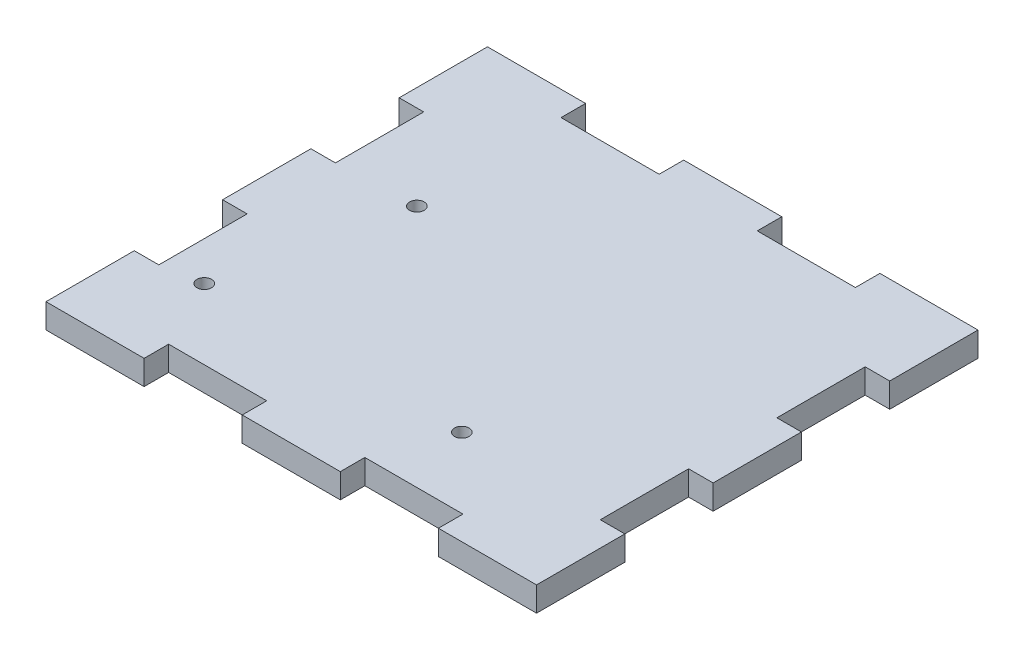
ISO-10303-21;
HEADER;
FILE_DESCRIPTION(('STEP AP214'),'2;1');
FILE_NAME('part.step','',(''),(''),'','','');
FILE_SCHEMA(('AUTOMOTIVE_DESIGN { 1 0 10303 214 1 1 1 1 }'));
ENDSEC;
DATA;
#1=APPLICATION_CONTEXT('core data for automotive mechanical design processes');
#2=APPLICATION_PROTOCOL_DEFINITION('international standard','automotive_design',2000,#1);
#3=PRODUCT_CONTEXT('',#1,'mechanical');
#4=PRODUCT('Part','Part','',(#3));
#5=PRODUCT_RELATED_PRODUCT_CATEGORY('part','',(#4));
#6=PRODUCT_DEFINITION_FORMATION('','',#4);
#7=PRODUCT_DEFINITION_CONTEXT('part definition',#1,'design');
#8=PRODUCT_DEFINITION('design','',#6,#7);
#9=PRODUCT_DEFINITION_SHAPE('','',#8);
#10=(LENGTH_UNIT() NAMED_UNIT(*) SI_UNIT(.MILLI.,.METRE.));
#11=(NAMED_UNIT(*) PLANE_ANGLE_UNIT() SI_UNIT($,.RADIAN.));
#12=(NAMED_UNIT(*) SI_UNIT($,.STERADIAN.) SOLID_ANGLE_UNIT());
#13=UNCERTAINTY_MEASURE_WITH_UNIT(LENGTH_MEASURE(1.E-05),#10,'distance_accuracy_value','');
#14=(GEOMETRIC_REPRESENTATION_CONTEXT(3) GLOBAL_UNCERTAINTY_ASSIGNED_CONTEXT((#13)) GLOBAL_UNIT_ASSIGNED_CONTEXT((#10,
#11,#12)) REPRESENTATION_CONTEXT('',''));
#15=CARTESIAN_POINT('',(0.,0.,0.));
#16=DIRECTION('',(0.,0.,1.));
#17=DIRECTION('',(1.,0.,0.));
#18=AXIS2_PLACEMENT_3D('',#15,#16,#17);
#19=CARTESIAN_POINT('',(-63.5,6.35,57.15));
#20=DIRECTION('',(0.,0.,-1.));
#21=DIRECTION('',(-1.,0.,0.));
#22=AXIS2_PLACEMENT_3D('',#19,#20,#21);
#23=PLANE('',#22);
#24=DIRECTION('',(1.,0.,0.));
#25=VECTOR('',#24,1.);
#26=CARTESIAN_POINT('',(-63.5,6.35,57.15));
#27=LINE('',#26,#25);
#28=CARTESIAN_POINT('',(-12.7,6.35,57.15));
#29=VERTEX_POINT('',#28);
#30=CARTESIAN_POINT('',(12.7,6.35,57.15));
#31=VERTEX_POINT('',#30);
#32=EDGE_CURVE('E521',#29,#31,#27,.T.);
#33=ORIENTED_EDGE('',*,*,#32,.F.);
#34=DIRECTION('',(0.,1.,0.));
#35=VECTOR('',#34,1.);
#36=CARTESIAN_POINT('',(-12.7,0.,57.15));
#37=LINE('',#36,#35);
#38=CARTESIAN_POINT('',(-12.7,0.,57.15));
#39=VERTEX_POINT('',#38);
#40=EDGE_CURVE('E314',#39,#29,#37,.T.);
#41=ORIENTED_EDGE('',*,*,#40,.F.);
#42=DIRECTION('',(1.,0.,0.));
#43=VECTOR('',#42,1.);
#44=CARTESIAN_POINT('',(-63.5,0.,57.15));
#45=LINE('',#44,#43);
#46=CARTESIAN_POINT('',(12.7,0.,57.15));
#47=VERTEX_POINT('',#46);
#48=EDGE_CURVE('E68',#39,#47,#45,.T.);
#49=ORIENTED_EDGE('',*,*,#48,.T.);
#50=DIRECTION('',(0.,1.,0.));
#51=VECTOR('',#50,1.);
#52=CARTESIAN_POINT('',(12.7,0.,57.15));
#53=LINE('',#52,#51);
#54=EDGE_CURVE('E340',#47,#31,#53,.T.);
#55=ORIENTED_EDGE('',*,*,#54,.T.);
#56=EDGE_LOOP('',(#33,#41,#49,#55));
#57=FACE_BOUND('',#56,.T.);
#58=ADVANCED_FACE('F45',(#57),#23,.F.);
#59=CARTESIAN_POINT('',(38.1,6.35,57.15));
#60=VERTEX_POINT('',#59);
#61=CARTESIAN_POINT('',(63.5,6.35,57.15));
#62=VERTEX_POINT('',#61);
#63=EDGE_CURVE('E515',#60,#62,#27,.T.);
#64=ORIENTED_EDGE('',*,*,#63,.F.);
#65=DIRECTION('',(0.,1.,0.));
#66=VECTOR('',#65,1.);
#67=CARTESIAN_POINT('',(38.1,0.,57.15));
#68=LINE('',#67,#66);
#69=CARTESIAN_POINT('',(38.1,0.,57.15));
#70=VERTEX_POINT('',#69);
#71=EDGE_CURVE('E338',#70,#60,#68,.T.);
#72=ORIENTED_EDGE('',*,*,#71,.F.);
#73=CARTESIAN_POINT('',(63.5,0.,57.15));
#74=VERTEX_POINT('',#73);
#75=EDGE_CURVE('E535',#70,#74,#45,.T.);
#76=ORIENTED_EDGE('',*,*,#75,.T.);
#77=DIRECTION('',(0.,-1.,0.));
#78=VECTOR('',#77,1.);
#79=CARTESIAN_POINT('',(63.5,6.35,57.15));
#80=LINE('',#79,#78);
#81=EDGE_CURVE('E520',#62,#74,#80,.T.);
#82=ORIENTED_EDGE('',*,*,#81,.F.);
#83=EDGE_LOOP('',(#64,#72,#76,#82));
#84=FACE_BOUND('',#83,.T.);
#85=ADVANCED_FACE('F593',(#84),#23,.F.);
#86=CARTESIAN_POINT('',(63.5,6.35,57.15));
#87=DIRECTION('',(-1.,0.,0.));
#88=DIRECTION('',(0.,0.,1.));
#89=AXIS2_PLACEMENT_3D('',#86,#87,#88);
#90=PLANE('',#89);
#91=DIRECTION('',(0.,0.,-1.));
#92=VECTOR('',#91,1.);
#93=CARTESIAN_POINT('',(63.5,0.,57.15));
#94=LINE('',#93,#92);
#95=CARTESIAN_POINT('',(63.5,0.,11.43));
#96=VERTEX_POINT('',#95);
#97=CARTESIAN_POINT('',(63.5,0.,-11.43));
#98=VERTEX_POINT('',#97);
#99=EDGE_CURVE('E526',#96,#98,#94,.T.);
#100=ORIENTED_EDGE('',*,*,#99,.T.);
#101=DIRECTION('',(0.,1.,0.));
#102=VECTOR('',#101,1.);
#103=CARTESIAN_POINT('',(63.5,0.,-11.43));
#104=LINE('',#103,#102);
#105=CARTESIAN_POINT('',(63.5,6.35,-11.43));
#106=VERTEX_POINT('',#105);
#107=EDGE_CURVE('E353',#98,#106,#104,.T.);
#108=ORIENTED_EDGE('',*,*,#107,.T.);
#109=DIRECTION('',(0.,0.,-1.));
#110=VECTOR('',#109,1.);
#111=CARTESIAN_POINT('',(63.5,6.35,57.15));
#112=LINE('',#111,#110);
#113=CARTESIAN_POINT('',(63.5,6.35,11.43));
#114=VERTEX_POINT('',#113);
#115=EDGE_CURVE('E505',#114,#106,#112,.T.);
#116=ORIENTED_EDGE('',*,*,#115,.F.);
#117=DIRECTION('',(0.,1.,0.));
#118=VECTOR('',#117,1.);
#119=CARTESIAN_POINT('',(63.5,0.,11.43));
#120=LINE('',#119,#118);
#121=EDGE_CURVE('E391',#96,#114,#120,.T.);
#122=ORIENTED_EDGE('',*,*,#121,.F.);
#123=EDGE_LOOP('',(#100,#108,#116,#122));
#124=FACE_BOUND('',#123,.T.);
#125=ADVANCED_FACE('F599',(#124),#90,.F.);
#126=CARTESIAN_POINT('',(63.5,0.,34.29));
#127=VERTEX_POINT('',#126);
#128=EDGE_CURVE('E522',#74,#127,#94,.T.);
#129=ORIENTED_EDGE('',*,*,#128,.T.);
#130=DIRECTION('',(0.,1.,0.));
#131=VECTOR('',#130,1.);
#132=CARTESIAN_POINT('',(63.5,0.,34.29));
#133=LINE('',#132,#131);
#134=CARTESIAN_POINT('',(63.5,6.35,34.29));
#135=VERTEX_POINT('',#134);
#136=EDGE_CURVE('E379',#127,#135,#133,.T.);
#137=ORIENTED_EDGE('',*,*,#136,.T.);
#138=EDGE_CURVE('E501',#62,#135,#112,.T.);
#139=ORIENTED_EDGE('',*,*,#138,.F.);
#140=ORIENTED_EDGE('',*,*,#81,.T.);
#141=EDGE_LOOP('',(#129,#137,#139,#140));
#142=FACE_BOUND('',#141,.T.);
#143=ADVANCED_FACE('F651',(#142),#90,.F.);
#144=CARTESIAN_POINT('',(-63.5,6.35,-57.15));
#145=DIRECTION('',(0.,0.,1.));
#146=DIRECTION('',(1.,0.,0.));
#147=AXIS2_PLACEMENT_3D('',#144,#145,#146);
#148=PLANE('',#147);
#149=DIRECTION('',(-1.,0.,0.));
#150=VECTOR('',#149,1.);
#151=CARTESIAN_POINT('',(-63.5,6.35,-57.15));
#152=LINE('',#151,#150);
#153=CARTESIAN_POINT('',(12.7,6.35,-57.15));
#154=VERTEX_POINT('',#153);
#155=CARTESIAN_POINT('',(-12.7,6.35,-57.15));
#156=VERTEX_POINT('',#155);
#157=EDGE_CURVE('E511',#154,#156,#152,.T.);
#158=ORIENTED_EDGE('',*,*,#157,.F.);
#159=DIRECTION('',(0.,1.,0.));
#160=VECTOR('',#159,1.);
#161=CARTESIAN_POINT('',(12.7,0.,-57.15));
#162=LINE('',#161,#160);
#163=CARTESIAN_POINT('',(12.7,0.,-57.15));
#164=VERTEX_POINT('',#163);
#165=EDGE_CURVE('E412',#164,#154,#162,.T.);
#166=ORIENTED_EDGE('',*,*,#165,.F.);
#167=DIRECTION('',(-1.,0.,0.));
#168=VECTOR('',#167,1.);
#169=CARTESIAN_POINT('',(-63.5,0.,-57.15));
#170=LINE('',#169,#168);
#171=CARTESIAN_POINT('',(-12.7,0.,-57.15));
#172=VERTEX_POINT('',#171);
#173=EDGE_CURVE('E531',#164,#172,#170,.T.);
#174=ORIENTED_EDGE('',*,*,#173,.T.);
#175=DIRECTION('',(0.,1.,0.));
#176=VECTOR('',#175,1.);
#177=CARTESIAN_POINT('',(-12.7,0.,-57.15));
#178=LINE('',#177,#176);
#179=EDGE_CURVE('E442',#172,#156,#178,.T.);
#180=ORIENTED_EDGE('',*,*,#179,.T.);
#181=EDGE_LOOP('',(#158,#166,#174,#180));
#182=FACE_BOUND('',#181,.T.);
#183=ADVANCED_FACE('F572',(#182),#148,.F.);
#184=CARTESIAN_POINT('',(-38.1,6.35,-57.15));
#185=VERTEX_POINT('',#184);
#186=CARTESIAN_POINT('',(-63.5,6.35,-57.15));
#187=VERTEX_POINT('',#186);
#188=EDGE_CURVE('E504',#185,#187,#152,.T.);
#189=ORIENTED_EDGE('',*,*,#188,.F.);
#190=DIRECTION('',(0.,1.,0.));
#191=VECTOR('',#190,1.);
#192=CARTESIAN_POINT('',(-38.1,0.,-57.15));
#193=LINE('',#192,#191);
#194=CARTESIAN_POINT('',(-38.1,0.,-57.15));
#195=VERTEX_POINT('',#194);
#196=EDGE_CURVE('E439',#195,#185,#193,.T.);
#197=ORIENTED_EDGE('',*,*,#196,.F.);
#198=CARTESIAN_POINT('',(-63.5,0.,-57.15));
#199=VERTEX_POINT('',#198);
#200=EDGE_CURVE('E525',#195,#199,#170,.T.);
#201=ORIENTED_EDGE('',*,*,#200,.T.);
#202=DIRECTION('',(0.,-1.,0.));
#203=VECTOR('',#202,1.);
#204=CARTESIAN_POINT('',(-63.5,6.35,-57.15));
#205=LINE('',#204,#203);
#206=EDGE_CURVE('E53',#187,#199,#205,.T.);
#207=ORIENTED_EDGE('',*,*,#206,.F.);
#208=EDGE_LOOP('',(#189,#197,#201,#207));
#209=FACE_BOUND('',#208,.T.);
#210=ADVANCED_FACE('F574',(#209),#148,.F.);
#211=CARTESIAN_POINT('',(-63.5,6.35,57.15));
#212=DIRECTION('',(1.,0.,0.));
#213=DIRECTION('',(0.,0.,-1.));
#214=AXIS2_PLACEMENT_3D('',#211,#212,#213);
#215=PLANE('',#214);
#216=DIRECTION('',(0.,0.,1.));
#217=VECTOR('',#216,1.);
#218=CARTESIAN_POINT('',(-63.5,0.,57.15));
#219=LINE('',#218,#217);
#220=CARTESIAN_POINT('',(-63.5,0.,-34.29));
#221=VERTEX_POINT('',#220);
#222=EDGE_CURVE('E532',#199,#221,#219,.T.);
#223=ORIENTED_EDGE('',*,*,#222,.T.);
#224=DIRECTION('',(0.,1.,0.));
#225=VECTOR('',#224,1.);
#226=CARTESIAN_POINT('',(-63.5,0.,-34.29));
#227=LINE('',#226,#225);
#228=CARTESIAN_POINT('',(-63.5,6.35,-34.29));
#229=VERTEX_POINT('',#228);
#230=EDGE_CURVE('E465',#221,#229,#227,.T.);
#231=ORIENTED_EDGE('',*,*,#230,.T.);
#232=DIRECTION('',(0.,0.,1.));
#233=VECTOR('',#232,1.);
#234=CARTESIAN_POINT('',(-63.5,6.35,57.15));
#235=LINE('',#234,#233);
#236=EDGE_CURVE('E512',#187,#229,#235,.T.);
#237=ORIENTED_EDGE('',*,*,#236,.F.);
#238=ORIENTED_EDGE('',*,*,#206,.T.);
#239=EDGE_LOOP('',(#223,#231,#237,#238));
#240=FACE_BOUND('',#239,.T.);
#241=ADVANCED_FACE('F548',(#240),#215,.F.);
#242=CARTESIAN_POINT('',(-63.5,6.35,-11.43));
#243=VERTEX_POINT('',#242);
#244=CARTESIAN_POINT('',(-63.5,6.35,11.43));
#245=VERTEX_POINT('',#244);
#246=EDGE_CURVE('E516',#243,#245,#235,.T.);
#247=ORIENTED_EDGE('',*,*,#246,.F.);
#248=DIRECTION('',(0.,1.,0.));
#249=VECTOR('',#248,1.);
#250=CARTESIAN_POINT('',(-63.5,0.,-11.43));
#251=LINE('',#250,#249);
#252=CARTESIAN_POINT('',(-63.5,0.,-11.43));
#253=VERTEX_POINT('',#252);
#254=EDGE_CURVE('E458',#253,#243,#251,.T.);
#255=ORIENTED_EDGE('',*,*,#254,.F.);
#256=CARTESIAN_POINT('',(-63.5,0.,11.43));
#257=VERTEX_POINT('',#256);
#258=EDGE_CURVE('E536',#253,#257,#219,.T.);
#259=ORIENTED_EDGE('',*,*,#258,.T.);
#260=DIRECTION('',(0.,1.,0.));
#261=VECTOR('',#260,1.);
#262=CARTESIAN_POINT('',(-63.5,0.,11.43));
#263=LINE('',#262,#261);
#264=EDGE_CURVE('E492',#257,#245,#263,.T.);
#265=ORIENTED_EDGE('',*,*,#264,.T.);
#266=EDGE_LOOP('',(#247,#255,#259,#265));
#267=FACE_BOUND('',#266,.T.);
#268=ADVANCED_FACE('F615',(#267),#215,.F.);
#269=CARTESIAN_POINT('',(63.5,6.35,-34.29));
#270=VERTEX_POINT('',#269);
#271=CARTESIAN_POINT('',(63.5,6.35,-57.15));
#272=VERTEX_POINT('',#271);
#273=EDGE_CURVE('E506',#270,#272,#112,.T.);
#274=ORIENTED_EDGE('',*,*,#273,.F.);
#275=DIRECTION('',(0.,1.,0.));
#276=VECTOR('',#275,1.);
#277=CARTESIAN_POINT('',(63.5,0.,-34.29));
#278=LINE('',#277,#276);
#279=CARTESIAN_POINT('',(63.5,0.,-34.29));
#280=VERTEX_POINT('',#279);
#281=EDGE_CURVE('E365',#280,#270,#278,.T.);
#282=ORIENTED_EDGE('',*,*,#281,.F.);
#283=CARTESIAN_POINT('',(63.5,0.,-57.15));
#284=VERTEX_POINT('',#283);
#285=EDGE_CURVE('E495',#280,#284,#94,.T.);
#286=ORIENTED_EDGE('',*,*,#285,.T.);
#287=DIRECTION('',(0.,-1.,0.));
#288=VECTOR('',#287,1.);
#289=CARTESIAN_POINT('',(63.5,6.35,-57.15));
#290=LINE('',#289,#288);
#291=EDGE_CURVE('E13',#272,#284,#290,.T.);
#292=ORIENTED_EDGE('',*,*,#291,.F.);
#293=EDGE_LOOP('',(#274,#282,#286,#292));
#294=FACE_BOUND('',#293,.T.);
#295=ADVANCED_FACE('F47',(#294),#90,.F.);
#296=CARTESIAN_POINT('',(38.1,0.,-57.15));
#297=VERTEX_POINT('',#296);
#298=EDGE_CURVE('E527',#284,#297,#170,.T.);
#299=ORIENTED_EDGE('',*,*,#298,.T.);
#300=DIRECTION('',(0.,1.,0.));
#301=VECTOR('',#300,1.);
#302=CARTESIAN_POINT('',(38.1,0.,-57.15));
#303=LINE('',#302,#301);
#304=CARTESIAN_POINT('',(38.1,6.35,-57.15));
#305=VERTEX_POINT('',#304);
#306=EDGE_CURVE('E415',#297,#305,#303,.T.);
#307=ORIENTED_EDGE('',*,*,#306,.T.);
#308=EDGE_CURVE('E507',#272,#305,#152,.T.);
#309=ORIENTED_EDGE('',*,*,#308,.F.);
#310=ORIENTED_EDGE('',*,*,#291,.T.);
#311=EDGE_LOOP('',(#299,#307,#309,#310));
#312=FACE_BOUND('',#311,.T.);
#313=ADVANCED_FACE('F613',(#312),#148,.F.);
#314=CARTESIAN_POINT('',(-63.5,6.35,34.29));
#315=VERTEX_POINT('',#314);
#316=CARTESIAN_POINT('',(-63.5,6.35,57.15));
#317=VERTEX_POINT('',#316);
#318=EDGE_CURVE('E510',#315,#317,#235,.T.);
#319=ORIENTED_EDGE('',*,*,#318,.F.);
#320=DIRECTION('',(0.,1.,0.));
#321=VECTOR('',#320,1.);
#322=CARTESIAN_POINT('',(-63.5,0.,34.29));
#323=LINE('',#322,#321);
#324=CARTESIAN_POINT('',(-63.5,0.,34.29));
#325=VERTEX_POINT('',#324);
#326=EDGE_CURVE('E484',#325,#315,#323,.T.);
#327=ORIENTED_EDGE('',*,*,#326,.F.);
#328=CARTESIAN_POINT('',(-63.5,0.,57.15));
#329=VERTEX_POINT('',#328);
#330=EDGE_CURVE('E530',#325,#329,#219,.T.);
#331=ORIENTED_EDGE('',*,*,#330,.T.);
#332=DIRECTION('',(0.,-1.,0.));
#333=VECTOR('',#332,1.);
#334=CARTESIAN_POINT('',(-63.5,6.35,57.15));
#335=LINE('',#334,#333);
#336=EDGE_CURVE('E541',#317,#329,#335,.T.);
#337=ORIENTED_EDGE('',*,*,#336,.F.);
#338=EDGE_LOOP('',(#319,#327,#331,#337));
#339=FACE_BOUND('',#338,.T.);
#340=ADVANCED_FACE('F605',(#339),#215,.F.);
#341=CARTESIAN_POINT('',(-38.1,0.,57.15));
#342=VERTEX_POINT('',#341);
#343=EDGE_CURVE('E537',#329,#342,#45,.T.);
#344=ORIENTED_EDGE('',*,*,#343,.T.);
#345=DIRECTION('',(0.,1.,0.));
#346=VECTOR('',#345,1.);
#347=CARTESIAN_POINT('',(-38.1,0.,57.15));
#348=LINE('',#347,#346);
#349=CARTESIAN_POINT('',(-38.1,6.35,57.15));
#350=VERTEX_POINT('',#349);
#351=EDGE_CURVE('E60',#342,#350,#348,.T.);
#352=ORIENTED_EDGE('',*,*,#351,.T.);
#353=EDGE_CURVE('E517',#317,#350,#27,.T.);
#354=ORIENTED_EDGE('',*,*,#353,.F.);
#355=ORIENTED_EDGE('',*,*,#336,.T.);
#356=EDGE_LOOP('',(#344,#352,#354,#355));
#357=FACE_BOUND('',#356,.T.);
#358=ADVANCED_FACE('F595',(#357),#23,.F.);
#359=CARTESIAN_POINT('',(63.5,6.35,-57.15));
#360=DIRECTION('',(0.,-1.,0.));
#361=DIRECTION('',(0.,0.,-1.));
#362=AXIS2_PLACEMENT_3D('',#359,#360,#361);
#363=PLANE('',#362);
#364=CARTESIAN_POINT('',(-36.9163229475794,6.35,-12.2807386859687));
#365=DIRECTION('',(0.,-1.,0.));
#366=DIRECTION('',(0.,0.,-1.));
#367=AXIS2_PLACEMENT_3D('',#364,#365,#366);
#368=CIRCLE('',#367,1.89865);
#369=CARTESIAN_POINT('',(-36.9163229475794,6.35,-14.1793886859687));
#370=VERTEX_POINT('',#369);
#371=EDGE_CURVE('E745',#370,#370,#368,.T.);
#372=ORIENTED_EDGE('',*,*,#371,.T.);
#373=EDGE_LOOP('',(#372));
#374=FACE_BOUND('',#373,.T.);
#375=CARTESIAN_POINT('',(19.5986770524206,6.35,32.6007386859689));
#376=DIRECTION('',(0.,1.,0.));
#377=DIRECTION('',(0.,0.,1.));
#378=AXIS2_PLACEMENT_3D('',#375,#376,#377);
#379=CIRCLE('',#378,1.89865);
#380=CARTESIAN_POINT('',(19.5986770524206,6.35,34.4993886859689));
#381=VERTEX_POINT('',#380);
#382=EDGE_CURVE('E751',#381,#381,#379,.T.);
#383=ORIENTED_EDGE('',*,*,#382,.F.);
#384=EDGE_LOOP('',(#383));
#385=FACE_BOUND('',#384,.T.);
#386=CARTESIAN_POINT('',(-47.0763229475794,6.35,32.6007386859689));
#387=DIRECTION('',(0.,1.,0.));
#388=DIRECTION('',(0.,0.,1.));
#389=AXIS2_PLACEMENT_3D('',#386,#387,#388);
#390=CIRCLE('',#389,1.89865);
#391=CARTESIAN_POINT('',(-47.0763229475794,6.35,34.4993886859689));
#392=VERTEX_POINT('',#391);
#393=EDGE_CURVE('E304',#392,#392,#390,.T.);
#394=ORIENTED_EDGE('',*,*,#393,.F.);
#395=EDGE_LOOP('',(#394));
#396=FACE_BOUND('',#395,.T.);
#397=DIRECTION('',(-1.,0.,0.));
#398=VECTOR('',#397,1.);
#399=CARTESIAN_POINT('',(-38.1,6.35,50.8));
#400=LINE('',#399,#398);
#401=CARTESIAN_POINT('',(-12.7,6.35,50.8));
#402=VERTEX_POINT('',#401);
#403=CARTESIAN_POINT('',(-38.1,6.35,50.8));
#404=VERTEX_POINT('',#403);
#405=EDGE_CURVE('E287',#402,#404,#400,.T.);
#406=ORIENTED_EDGE('',*,*,#405,.F.);
#407=DIRECTION('',(0.,0.,-1.));
#408=VECTOR('',#407,1.);
#409=CARTESIAN_POINT('',(-12.7,6.35,57.15));
#410=LINE('',#409,#408);
#411=EDGE_CURVE('E298',#29,#402,#410,.T.);
#412=ORIENTED_EDGE('',*,*,#411,.F.);
#413=ORIENTED_EDGE('',*,*,#32,.T.);
#414=DIRECTION('',(0.,0.,1.));
#415=VECTOR('',#414,1.);
#416=CARTESIAN_POINT('',(12.7,6.35,57.15));
#417=LINE('',#416,#415);
#418=CARTESIAN_POINT('',(12.7,6.35,50.8));
#419=VERTEX_POINT('',#418);
#420=EDGE_CURVE('E330',#419,#31,#417,.T.);
#421=ORIENTED_EDGE('',*,*,#420,.F.);
#422=DIRECTION('',(-1.,0.,0.));
#423=VECTOR('',#422,1.);
#424=CARTESIAN_POINT('',(12.7,6.35,50.8));
#425=LINE('',#424,#423);
#426=CARTESIAN_POINT('',(38.1,6.35,50.8));
#427=VERTEX_POINT('',#426);
#428=EDGE_CURVE('E313',#427,#419,#425,.T.);
#429=ORIENTED_EDGE('',*,*,#428,.F.);
#430=DIRECTION('',(0.,0.,-1.));
#431=VECTOR('',#430,1.);
#432=CARTESIAN_POINT('',(38.1,6.35,57.15));
#433=LINE('',#432,#431);
#434=EDGE_CURVE('E321',#60,#427,#433,.T.);
#435=ORIENTED_EDGE('',*,*,#434,.F.);
#436=ORIENTED_EDGE('',*,*,#63,.T.);
#437=ORIENTED_EDGE('',*,*,#138,.T.);
#438=DIRECTION('',(1.,0.,0.));
#439=VECTOR('',#438,1.);
#440=CARTESIAN_POINT('',(63.5,6.35,34.29));
#441=LINE('',#440,#439);
#442=CARTESIAN_POINT('',(57.15,6.35,34.29));
#443=VERTEX_POINT('',#442);
#444=EDGE_CURVE('E362',#443,#135,#441,.T.);
#445=ORIENTED_EDGE('',*,*,#444,.F.);
#446=DIRECTION('',(0.,0.,1.));
#447=VECTOR('',#446,1.);
#448=CARTESIAN_POINT('',(57.15,6.35,34.29));
#449=LINE('',#448,#447);
#450=CARTESIAN_POINT('',(57.15,6.35,11.43));
#451=VERTEX_POINT('',#450);
#452=EDGE_CURVE('E373',#451,#443,#449,.T.);
#453=ORIENTED_EDGE('',*,*,#452,.F.);
#454=DIRECTION('',(-1.,0.,0.));
#455=VECTOR('',#454,1.);
#456=CARTESIAN_POINT('',(63.5,6.35,11.43));
#457=LINE('',#456,#455);
#458=EDGE_CURVE('E381',#114,#451,#457,.T.);
#459=ORIENTED_EDGE('',*,*,#458,.F.);
#460=ORIENTED_EDGE('',*,*,#115,.T.);
#461=DIRECTION('',(1.,0.,0.));
#462=VECTOR('',#461,1.);
#463=CARTESIAN_POINT('',(63.5,6.35,-11.43));
#464=LINE('',#463,#462);
#465=CARTESIAN_POINT('',(57.15,6.35,-11.43));
#466=VERTEX_POINT('',#465);
#467=EDGE_CURVE('E337',#466,#106,#464,.T.);
#468=ORIENTED_EDGE('',*,*,#467,.F.);
#469=DIRECTION('',(0.,0.,1.));
#470=VECTOR('',#469,1.);
#471=CARTESIAN_POINT('',(57.15,6.35,-11.43));
#472=LINE('',#471,#470);
#473=CARTESIAN_POINT('',(57.15,6.35,-34.29));
#474=VERTEX_POINT('',#473);
#475=EDGE_CURVE('E347',#474,#466,#472,.T.);
#476=ORIENTED_EDGE('',*,*,#475,.F.);
#477=DIRECTION('',(-1.,0.,0.));
#478=VECTOR('',#477,1.);
#479=CARTESIAN_POINT('',(63.5,6.35,-34.29));
#480=LINE('',#479,#478);
#481=EDGE_CURVE('E355',#270,#474,#480,.T.);
#482=ORIENTED_EDGE('',*,*,#481,.F.);
#483=ORIENTED_EDGE('',*,*,#273,.T.);
#484=ORIENTED_EDGE('',*,*,#308,.T.);
#485=DIRECTION('',(0.,0.,-1.));
#486=VECTOR('',#485,1.);
#487=CARTESIAN_POINT('',(38.1,6.35,-57.15));
#488=LINE('',#487,#486);
#489=CARTESIAN_POINT('',(38.1,6.35,-50.8));
#490=VERTEX_POINT('',#489);
#491=EDGE_CURVE('E399',#490,#305,#488,.T.);
#492=ORIENTED_EDGE('',*,*,#491,.F.);
#493=DIRECTION('',(1.,0.,0.));
#494=VECTOR('',#493,1.);
#495=CARTESIAN_POINT('',(12.7,6.35,-50.8));
#496=LINE('',#495,#494);
#497=CARTESIAN_POINT('',(12.7,6.35,-50.8));
#498=VERTEX_POINT('',#497);
#499=EDGE_CURVE('E408',#498,#490,#496,.T.);
#500=ORIENTED_EDGE('',*,*,#499,.F.);
#501=DIRECTION('',(0.,0.,1.));
#502=VECTOR('',#501,1.);
#503=CARTESIAN_POINT('',(12.7,6.35,-57.15));
#504=LINE('',#503,#502);
#505=EDGE_CURVE('E388',#154,#498,#504,.T.);
#506=ORIENTED_EDGE('',*,*,#505,.F.);
#507=ORIENTED_EDGE('',*,*,#157,.T.);
#508=DIRECTION('',(0.,0.,-1.));
#509=VECTOR('',#508,1.);
#510=CARTESIAN_POINT('',(-12.7,6.35,-57.15));
#511=LINE('',#510,#509);
#512=CARTESIAN_POINT('',(-12.7,6.35,-50.8));
#513=VERTEX_POINT('',#512);
#514=EDGE_CURVE('E425',#513,#156,#511,.T.);
#515=ORIENTED_EDGE('',*,*,#514,.F.);
#516=DIRECTION('',(1.,0.,0.));
#517=VECTOR('',#516,1.);
#518=CARTESIAN_POINT('',(-38.1,6.35,-50.8));
#519=LINE('',#518,#517);
#520=CARTESIAN_POINT('',(-38.1,6.35,-50.8));
#521=VERTEX_POINT('',#520);
#522=EDGE_CURVE('E434',#521,#513,#519,.T.);
#523=ORIENTED_EDGE('',*,*,#522,.F.);
#524=DIRECTION('',(0.,0.,1.));
#525=VECTOR('',#524,1.);
#526=CARTESIAN_POINT('',(-38.1,6.35,-57.15));
#527=LINE('',#526,#525);
#528=EDGE_CURVE('E414',#185,#521,#527,.T.);
#529=ORIENTED_EDGE('',*,*,#528,.F.);
#530=ORIENTED_EDGE('',*,*,#188,.T.);
#531=ORIENTED_EDGE('',*,*,#236,.T.);
#532=DIRECTION('',(-1.,0.,0.));
#533=VECTOR('',#532,1.);
#534=CARTESIAN_POINT('',(-63.5,6.35,-34.29));
#535=LINE('',#534,#533);
#536=CARTESIAN_POINT('',(-57.15,6.35,-34.29));
#537=VERTEX_POINT('',#536);
#538=EDGE_CURVE('E452',#537,#229,#535,.T.);
#539=ORIENTED_EDGE('',*,*,#538,.F.);
#540=DIRECTION('',(0.,0.,-1.));
#541=VECTOR('',#540,1.);
#542=CARTESIAN_POINT('',(-57.15,6.35,-11.43));
#543=LINE('',#542,#541);
#544=CARTESIAN_POINT('',(-57.15,6.35,-11.43));
#545=VERTEX_POINT('',#544);
#546=EDGE_CURVE('E461',#545,#537,#543,.T.);
#547=ORIENTED_EDGE('',*,*,#546,.F.);
#548=DIRECTION('',(1.,0.,0.));
#549=VECTOR('',#548,1.);
#550=CARTESIAN_POINT('',(-63.5,6.35,-11.43));
#551=LINE('',#550,#549);
#552=EDGE_CURVE('E441',#243,#545,#551,.T.);
#553=ORIENTED_EDGE('',*,*,#552,.F.);
#554=ORIENTED_EDGE('',*,*,#246,.T.);
#555=DIRECTION('',(-1.,0.,0.));
#556=VECTOR('',#555,1.);
#557=CARTESIAN_POINT('',(-63.5,6.35,11.43));
#558=LINE('',#557,#556);
#559=CARTESIAN_POINT('',(-57.15,6.35,11.43));
#560=VERTEX_POINT('',#559);
#561=EDGE_CURVE('E478',#560,#245,#558,.T.);
#562=ORIENTED_EDGE('',*,*,#561,.F.);
#563=DIRECTION('',(0.,0.,-1.));
#564=VECTOR('',#563,1.);
#565=CARTESIAN_POINT('',(-57.15,6.35,34.29));
#566=LINE('',#565,#564);
#567=CARTESIAN_POINT('',(-57.15,6.35,34.29));
#568=VERTEX_POINT('',#567);
#569=EDGE_CURVE('E487',#568,#560,#566,.T.);
#570=ORIENTED_EDGE('',*,*,#569,.F.);
#571=DIRECTION('',(1.,0.,0.));
#572=VECTOR('',#571,1.);
#573=CARTESIAN_POINT('',(-63.5,6.35,34.29));
#574=LINE('',#573,#572);
#575=EDGE_CURVE('E468',#315,#568,#574,.T.);
#576=ORIENTED_EDGE('',*,*,#575,.F.);
#577=ORIENTED_EDGE('',*,*,#318,.T.);
#578=ORIENTED_EDGE('',*,*,#353,.T.);
#579=DIRECTION('',(0.,0.,1.));
#580=VECTOR('',#579,1.);
#581=CARTESIAN_POINT('',(-38.1,6.35,57.15));
#582=LINE('',#581,#580);
#583=EDGE_CURVE('E301',#404,#350,#582,.T.);
#584=ORIENTED_EDGE('',*,*,#583,.F.);
#585=EDGE_LOOP('',(#406,#412,#413,#421,#429,#435,#436,#437,#445,#453,#459,#460,#468,#476,#482,
#483,#484,#492,#500,#506,#507,#515,#523,#529,#530,#531,#539,#547,#553,#554,#562,#570,#576,#577,
#578,#584));
#586=FACE_BOUND('',#585,.T.);
#587=ADVANCED_FACE('F557',(#374,#385,#396,#586),#363,.F.);
#588=CARTESIAN_POINT('',(63.5,0.,-57.15));
#589=DIRECTION('',(0.,-1.,0.));
#590=DIRECTION('',(0.,0.,-1.));
#591=AXIS2_PLACEMENT_3D('',#588,#589,#590);
#592=PLANE('',#591);
#593=CARTESIAN_POINT('',(-36.9163229475794,0.,-12.2807386859687));
#594=DIRECTION('',(0.,-1.,0.));
#595=DIRECTION('',(0.,0.,-1.));
#596=AXIS2_PLACEMENT_3D('',#593,#594,#595);
#597=CIRCLE('',#596,1.89865);
#598=CARTESIAN_POINT('',(-36.9163229475794,0.,-14.1793886859687));
#599=VERTEX_POINT('',#598);
#600=EDGE_CURVE('E748',#599,#599,#597,.T.);
#601=ORIENTED_EDGE('',*,*,#600,.F.);
#602=EDGE_LOOP('',(#601));
#603=FACE_BOUND('',#602,.T.);
#604=CARTESIAN_POINT('',(19.5986770524206,0.,32.6007386859689));
#605=DIRECTION('',(0.,1.,0.));
#606=DIRECTION('',(0.,0.,1.));
#607=AXIS2_PLACEMENT_3D('',#604,#605,#606);
#608=CIRCLE('',#607,1.89865);
#609=CARTESIAN_POINT('',(19.5986770524206,0.,34.4993886859689));
#610=VERTEX_POINT('',#609);
#611=EDGE_CURVE('E754',#610,#610,#608,.T.);
#612=ORIENTED_EDGE('',*,*,#611,.T.);
#613=EDGE_LOOP('',(#612));
#614=FACE_BOUND('',#613,.T.);
#615=CARTESIAN_POINT('',(-47.0763229475794,0.,32.6007386859689));
#616=DIRECTION('',(0.,1.,0.));
#617=DIRECTION('',(0.,0.,1.));
#618=AXIS2_PLACEMENT_3D('',#615,#616,#617);
#619=CIRCLE('',#618,1.89865);
#620=CARTESIAN_POINT('',(-47.0763229475794,0.,34.4993886859689));
#621=VERTEX_POINT('',#620);
#622=EDGE_CURVE('E309',#621,#621,#619,.T.);
#623=ORIENTED_EDGE('',*,*,#622,.T.);
#624=EDGE_LOOP('',(#623));
#625=FACE_BOUND('',#624,.T.);
#626=DIRECTION('',(0.,0.,-1.));
#627=VECTOR('',#626,1.);
#628=CARTESIAN_POINT('',(-12.7,0.,57.15));
#629=LINE('',#628,#627);
#630=CARTESIAN_POINT('',(-12.7,0.,50.8));
#631=VERTEX_POINT('',#630);
#632=EDGE_CURVE('E289',#39,#631,#629,.T.);
#633=ORIENTED_EDGE('',*,*,#632,.T.);
#634=DIRECTION('',(-1.,0.,0.));
#635=VECTOR('',#634,1.);
#636=CARTESIAN_POINT('',(-38.1,0.,50.8));
#637=LINE('',#636,#635);
#638=CARTESIAN_POINT('',(-38.1,0.,50.8));
#639=VERTEX_POINT('',#638);
#640=EDGE_CURVE('E284',#631,#639,#637,.T.);
#641=ORIENTED_EDGE('',*,*,#640,.T.);
#642=DIRECTION('',(0.,0.,1.));
#643=VECTOR('',#642,1.);
#644=CARTESIAN_POINT('',(-38.1,0.,57.15));
#645=LINE('',#644,#643);
#646=EDGE_CURVE('E291',#639,#342,#645,.T.);
#647=ORIENTED_EDGE('',*,*,#646,.T.);
#648=ORIENTED_EDGE('',*,*,#343,.F.);
#649=ORIENTED_EDGE('',*,*,#330,.F.);
#650=DIRECTION('',(1.,0.,0.));
#651=VECTOR('',#650,1.);
#652=CARTESIAN_POINT('',(-63.5,0.,34.29));
#653=LINE('',#652,#651);
#654=CARTESIAN_POINT('',(-57.15,0.,34.29));
#655=VERTEX_POINT('',#654);
#656=EDGE_CURVE('E474',#325,#655,#653,.T.);
#657=ORIENTED_EDGE('',*,*,#656,.T.);
#658=DIRECTION('',(0.,0.,-1.));
#659=VECTOR('',#658,1.);
#660=CARTESIAN_POINT('',(-57.15,0.,34.29));
#661=LINE('',#660,#659);
#662=CARTESIAN_POINT('',(-57.15,0.,11.43));
#663=VERTEX_POINT('',#662);
#664=EDGE_CURVE('E477',#655,#663,#661,.T.);
#665=ORIENTED_EDGE('',*,*,#664,.T.);
#666=DIRECTION('',(-1.,0.,0.));
#667=VECTOR('',#666,1.);
#668=CARTESIAN_POINT('',(-63.5,0.,11.43));
#669=LINE('',#668,#667);
#670=EDGE_CURVE('E481',#663,#257,#669,.T.);
#671=ORIENTED_EDGE('',*,*,#670,.T.);
#672=ORIENTED_EDGE('',*,*,#258,.F.);
#673=DIRECTION('',(1.,0.,0.));
#674=VECTOR('',#673,1.);
#675=CARTESIAN_POINT('',(-63.5,0.,-11.43));
#676=LINE('',#675,#674);
#677=CARTESIAN_POINT('',(-57.15,0.,-11.43));
#678=VERTEX_POINT('',#677);
#679=EDGE_CURVE('E448',#253,#678,#676,.T.);
#680=ORIENTED_EDGE('',*,*,#679,.T.);
#681=DIRECTION('',(0.,0.,-1.));
#682=VECTOR('',#681,1.);
#683=CARTESIAN_POINT('',(-57.15,0.,-11.43));
#684=LINE('',#683,#682);
#685=CARTESIAN_POINT('',(-57.15,0.,-34.29));
#686=VERTEX_POINT('',#685);
#687=EDGE_CURVE('E451',#678,#686,#684,.T.);
#688=ORIENTED_EDGE('',*,*,#687,.T.);
#689=DIRECTION('',(-1.,0.,0.));
#690=VECTOR('',#689,1.);
#691=CARTESIAN_POINT('',(-63.5,0.,-34.29));
#692=LINE('',#691,#690);
#693=EDGE_CURVE('E455',#686,#221,#692,.T.);
#694=ORIENTED_EDGE('',*,*,#693,.T.);
#695=ORIENTED_EDGE('',*,*,#222,.F.);
#696=ORIENTED_EDGE('',*,*,#200,.F.);
#697=DIRECTION('',(0.,0.,1.));
#698=VECTOR('',#697,1.);
#699=CARTESIAN_POINT('',(-38.1,0.,-57.15));
#700=LINE('',#699,#698);
#701=CARTESIAN_POINT('',(-38.1,0.,-50.8));
#702=VERTEX_POINT('',#701);
#703=EDGE_CURVE('E421',#195,#702,#700,.T.);
#704=ORIENTED_EDGE('',*,*,#703,.T.);
#705=DIRECTION('',(1.,0.,0.));
#706=VECTOR('',#705,1.);
#707=CARTESIAN_POINT('',(-38.1,0.,-50.8));
#708=LINE('',#707,#706);
#709=CARTESIAN_POINT('',(-12.7,0.,-50.8));
#710=VERTEX_POINT('',#709);
#711=EDGE_CURVE('E424',#702,#710,#708,.T.);
#712=ORIENTED_EDGE('',*,*,#711,.T.);
#713=DIRECTION('',(0.,0.,-1.));
#714=VECTOR('',#713,1.);
#715=CARTESIAN_POINT('',(-12.7,0.,-57.15));
#716=LINE('',#715,#714);
#717=EDGE_CURVE('E428',#710,#172,#716,.T.);
#718=ORIENTED_EDGE('',*,*,#717,.T.);
#719=ORIENTED_EDGE('',*,*,#173,.F.);
#720=DIRECTION('',(0.,0.,1.));
#721=VECTOR('',#720,1.);
#722=CARTESIAN_POINT('',(12.7,0.,-57.15));
#723=LINE('',#722,#721);
#724=CARTESIAN_POINT('',(12.7,0.,-50.8));
#725=VERTEX_POINT('',#724);
#726=EDGE_CURVE('E395',#164,#725,#723,.T.);
#727=ORIENTED_EDGE('',*,*,#726,.T.);
#728=DIRECTION('',(1.,0.,0.));
#729=VECTOR('',#728,1.);
#730=CARTESIAN_POINT('',(12.7,0.,-50.8));
#731=LINE('',#730,#729);
#732=CARTESIAN_POINT('',(38.1,0.,-50.8));
#733=VERTEX_POINT('',#732);
#734=EDGE_CURVE('E398',#725,#733,#731,.T.);
#735=ORIENTED_EDGE('',*,*,#734,.T.);
#736=DIRECTION('',(0.,0.,-1.));
#737=VECTOR('',#736,1.);
#738=CARTESIAN_POINT('',(38.1,0.,-57.15));
#739=LINE('',#738,#737);
#740=EDGE_CURVE('E402',#733,#297,#739,.T.);
#741=ORIENTED_EDGE('',*,*,#740,.T.);
#742=ORIENTED_EDGE('',*,*,#298,.F.);
#743=ORIENTED_EDGE('',*,*,#285,.F.);
#744=DIRECTION('',(-1.,0.,0.));
#745=VECTOR('',#744,1.);
#746=CARTESIAN_POINT('',(63.5,0.,-34.29));
#747=LINE('',#746,#745);
#748=CARTESIAN_POINT('',(57.15,0.,-34.29));
#749=VERTEX_POINT('',#748);
#750=EDGE_CURVE('E346',#280,#749,#747,.T.);
#751=ORIENTED_EDGE('',*,*,#750,.T.);
#752=DIRECTION('',(0.,0.,1.));
#753=VECTOR('',#752,1.);
#754=CARTESIAN_POINT('',(57.15,0.,-11.43));
#755=LINE('',#754,#753);
#756=CARTESIAN_POINT('',(57.15,0.,-11.43));
#757=VERTEX_POINT('',#756);
#758=EDGE_CURVE('E350',#749,#757,#755,.T.);
#759=ORIENTED_EDGE('',*,*,#758,.T.);
#760=DIRECTION('',(1.,0.,0.));
#761=VECTOR('',#760,1.);
#762=CARTESIAN_POINT('',(63.5,0.,-11.43));
#763=LINE('',#762,#761);
#764=EDGE_CURVE('E343',#757,#98,#763,.T.);
#765=ORIENTED_EDGE('',*,*,#764,.T.);
#766=ORIENTED_EDGE('',*,*,#99,.F.);
#767=DIRECTION('',(-1.,0.,0.));
#768=VECTOR('',#767,1.);
#769=CARTESIAN_POINT('',(63.5,0.,11.43));
#770=LINE('',#769,#768);
#771=CARTESIAN_POINT('',(57.15,0.,11.43));
#772=VERTEX_POINT('',#771);
#773=EDGE_CURVE('E372',#96,#772,#770,.T.);
#774=ORIENTED_EDGE('',*,*,#773,.T.);
#775=DIRECTION('',(0.,0.,1.));
#776=VECTOR('',#775,1.);
#777=CARTESIAN_POINT('',(57.15,0.,34.29));
#778=LINE('',#777,#776);
#779=CARTESIAN_POINT('',(57.15,0.,34.29));
#780=VERTEX_POINT('',#779);
#781=EDGE_CURVE('E376',#772,#780,#778,.T.);
#782=ORIENTED_EDGE('',*,*,#781,.T.);
#783=DIRECTION('',(1.,0.,0.));
#784=VECTOR('',#783,1.);
#785=CARTESIAN_POINT('',(63.5,0.,34.29));
#786=LINE('',#785,#784);
#787=EDGE_CURVE('E369',#780,#127,#786,.T.);
#788=ORIENTED_EDGE('',*,*,#787,.T.);
#789=ORIENTED_EDGE('',*,*,#128,.F.);
#790=ORIENTED_EDGE('',*,*,#75,.F.);
#791=DIRECTION('',(0.,0.,-1.));
#792=VECTOR('',#791,1.);
#793=CARTESIAN_POINT('',(38.1,0.,57.15));
#794=LINE('',#793,#792);
#795=CARTESIAN_POINT('',(38.1,0.,50.8));
#796=VERTEX_POINT('',#795);
#797=EDGE_CURVE('E324',#70,#796,#794,.T.);
#798=ORIENTED_EDGE('',*,*,#797,.T.);
#799=DIRECTION('',(-1.,0.,0.));
#800=VECTOR('',#799,1.);
#801=CARTESIAN_POINT('',(12.7,0.,50.8));
#802=LINE('',#801,#800);
#803=CARTESIAN_POINT('',(12.7,0.,50.8));
#804=VERTEX_POINT('',#803);
#805=EDGE_CURVE('E317',#796,#804,#802,.T.);
#806=ORIENTED_EDGE('',*,*,#805,.T.);
#807=DIRECTION('',(0.,0.,1.));
#808=VECTOR('',#807,1.);
#809=CARTESIAN_POINT('',(12.7,0.,57.15));
#810=LINE('',#809,#808);
#811=EDGE_CURVE('E320',#804,#47,#810,.T.);
#812=ORIENTED_EDGE('',*,*,#811,.T.);
#813=ORIENTED_EDGE('',*,*,#48,.F.);
#814=EDGE_LOOP('',(#633,#641,#647,#648,#649,#657,#665,#671,#672,#680,#688,#694,#695,#696,#704,
#712,#718,#719,#727,#735,#741,#742,#743,#751,#759,#765,#766,#774,#782,#788,#789,#790,#798,#806,
#812,#813));
#815=FACE_BOUND('',#814,.T.);
#816=ADVANCED_FACE('F297',(#603,#614,#625,#815),#592,.T.);
#817=CARTESIAN_POINT('',(-63.5,0.,11.43));
#818=DIRECTION('',(0.,0.,-1.));
#819=DIRECTION('',(-1.,0.,0.));
#820=AXIS2_PLACEMENT_3D('',#817,#818,#819);
#821=PLANE('',#820);
#822=ORIENTED_EDGE('',*,*,#561,.T.);
#823=ORIENTED_EDGE('',*,*,#264,.F.);
#824=ORIENTED_EDGE('',*,*,#670,.F.);
#825=DIRECTION('',(0.,1.,0.));
#826=VECTOR('',#825,1.);
#827=CARTESIAN_POINT('',(-57.15,0.,11.43));
#828=LINE('',#827,#826);
#829=EDGE_CURVE('E496',#663,#560,#828,.T.);
#830=ORIENTED_EDGE('',*,*,#829,.T.);
#831=EDGE_LOOP('',(#822,#823,#824,#830));
#832=FACE_BOUND('',#831,.T.);
#833=ADVANCED_FACE('F627',(#832),#821,.F.);
#834=CARTESIAN_POINT('',(-57.15,0.,34.29));
#835=DIRECTION('',(1.,0.,0.));
#836=DIRECTION('',(0.,0.,-1.));
#837=AXIS2_PLACEMENT_3D('',#834,#835,#836);
#838=PLANE('',#837);
#839=ORIENTED_EDGE('',*,*,#569,.T.);
#840=ORIENTED_EDGE('',*,*,#829,.F.);
#841=ORIENTED_EDGE('',*,*,#664,.F.);
#842=DIRECTION('',(0.,1.,0.));
#843=VECTOR('',#842,1.);
#844=CARTESIAN_POINT('',(-57.15,0.,34.29));
#845=LINE('',#844,#843);
#846=EDGE_CURVE('E498',#655,#568,#845,.T.);
#847=ORIENTED_EDGE('',*,*,#846,.T.);
#848=EDGE_LOOP('',(#839,#840,#841,#847));
#849=FACE_BOUND('',#848,.T.);
#850=ADVANCED_FACE('F631',(#849),#838,.F.);
#851=CARTESIAN_POINT('',(-63.5,0.,34.29));
#852=DIRECTION('',(0.,0.,1.));
#853=DIRECTION('',(1.,0.,0.));
#854=AXIS2_PLACEMENT_3D('',#851,#852,#853);
#855=PLANE('',#854);
#856=ORIENTED_EDGE('',*,*,#575,.T.);
#857=ORIENTED_EDGE('',*,*,#846,.F.);
#858=ORIENTED_EDGE('',*,*,#656,.F.);
#859=ORIENTED_EDGE('',*,*,#326,.T.);
#860=EDGE_LOOP('',(#856,#857,#858,#859));
#861=FACE_BOUND('',#860,.T.);
#862=ADVANCED_FACE('F633',(#861),#855,.F.);
#863=CARTESIAN_POINT('',(-63.5,0.,-34.29));
#864=DIRECTION('',(0.,0.,-1.));
#865=DIRECTION('',(-1.,0.,0.));
#866=AXIS2_PLACEMENT_3D('',#863,#864,#865);
#867=PLANE('',#866);
#868=ORIENTED_EDGE('',*,*,#538,.T.);
#869=ORIENTED_EDGE('',*,*,#230,.F.);
#870=ORIENTED_EDGE('',*,*,#693,.F.);
#871=DIRECTION('',(0.,1.,0.));
#872=VECTOR('',#871,1.);
#873=CARTESIAN_POINT('',(-57.15,0.,-34.29));
#874=LINE('',#873,#872);
#875=EDGE_CURVE('E469',#686,#537,#874,.T.);
#876=ORIENTED_EDGE('',*,*,#875,.T.);
#877=EDGE_LOOP('',(#868,#869,#870,#876));
#878=FACE_BOUND('',#877,.T.);
#879=ADVANCED_FACE('F554',(#878),#867,.F.);
#880=CARTESIAN_POINT('',(-57.15,0.,-11.43));
#881=DIRECTION('',(1.,0.,0.));
#882=DIRECTION('',(0.,0.,-1.));
#883=AXIS2_PLACEMENT_3D('',#880,#881,#882);
#884=PLANE('',#883);
#885=ORIENTED_EDGE('',*,*,#546,.T.);
#886=ORIENTED_EDGE('',*,*,#875,.F.);
#887=ORIENTED_EDGE('',*,*,#687,.F.);
#888=DIRECTION('',(0.,1.,0.));
#889=VECTOR('',#888,1.);
#890=CARTESIAN_POINT('',(-57.15,0.,-11.43));
#891=LINE('',#890,#889);
#892=EDGE_CURVE('E471',#678,#545,#891,.T.);
#893=ORIENTED_EDGE('',*,*,#892,.T.);
#894=EDGE_LOOP('',(#885,#886,#887,#893));
#895=FACE_BOUND('',#894,.T.);
#896=ADVANCED_FACE('F779',(#895),#884,.F.);
#897=CARTESIAN_POINT('',(-63.5,0.,-11.43));
#898=DIRECTION('',(0.,0.,1.));
#899=DIRECTION('',(1.,0.,0.));
#900=AXIS2_PLACEMENT_3D('',#897,#898,#899);
#901=PLANE('',#900);
#902=ORIENTED_EDGE('',*,*,#552,.T.);
#903=ORIENTED_EDGE('',*,*,#892,.F.);
#904=ORIENTED_EDGE('',*,*,#679,.F.);
#905=ORIENTED_EDGE('',*,*,#254,.T.);
#906=EDGE_LOOP('',(#902,#903,#904,#905));
#907=FACE_BOUND('',#906,.T.);
#908=ADVANCED_FACE('F776',(#907),#901,.F.);
#909=CARTESIAN_POINT('',(-38.1,0.,-57.15));
#910=DIRECTION('',(-1.,0.,0.));
#911=DIRECTION('',(0.,0.,1.));
#912=AXIS2_PLACEMENT_3D('',#909,#910,#911);
#913=PLANE('',#912);
#914=ORIENTED_EDGE('',*,*,#528,.T.);
#915=DIRECTION('',(0.,1.,0.));
#916=VECTOR('',#915,1.);
#917=CARTESIAN_POINT('',(-38.1,0.,-50.8));
#918=LINE('',#917,#916);
#919=EDGE_CURVE('E431',#702,#521,#918,.T.);
#920=ORIENTED_EDGE('',*,*,#919,.F.);
#921=ORIENTED_EDGE('',*,*,#703,.F.);
#922=ORIENTED_EDGE('',*,*,#196,.T.);
#923=EDGE_LOOP('',(#914,#920,#921,#922));
#924=FACE_BOUND('',#923,.T.);
#925=ADVANCED_FACE('F576',(#924),#913,.F.);
#926=CARTESIAN_POINT('',(-12.7,0.,-57.15));
#927=DIRECTION('',(1.,0.,0.));
#928=DIRECTION('',(0.,0.,-1.));
#929=AXIS2_PLACEMENT_3D('',#926,#927,#928);
#930=PLANE('',#929);
#931=ORIENTED_EDGE('',*,*,#514,.T.);
#932=ORIENTED_EDGE('',*,*,#179,.F.);
#933=ORIENTED_EDGE('',*,*,#717,.F.);
#934=DIRECTION('',(0.,1.,0.));
#935=VECTOR('',#934,1.);
#936=CARTESIAN_POINT('',(-12.7,0.,-50.8));
#937=LINE('',#936,#935);
#938=EDGE_CURVE('E445',#710,#513,#937,.T.);
#939=ORIENTED_EDGE('',*,*,#938,.T.);
#940=EDGE_LOOP('',(#931,#932,#933,#939));
#941=FACE_BOUND('',#940,.T.);
#942=ADVANCED_FACE('F570',(#941),#930,.F.);
#943=CARTESIAN_POINT('',(-38.1,0.,-50.8));
#944=DIRECTION('',(0.,0.,1.));
#945=DIRECTION('',(1.,0.,0.));
#946=AXIS2_PLACEMENT_3D('',#943,#944,#945);
#947=PLANE('',#946);
#948=ORIENTED_EDGE('',*,*,#522,.T.);
#949=ORIENTED_EDGE('',*,*,#938,.F.);
#950=ORIENTED_EDGE('',*,*,#711,.F.);
#951=ORIENTED_EDGE('',*,*,#919,.T.);
#952=EDGE_LOOP('',(#948,#949,#950,#951));
#953=FACE_BOUND('',#952,.T.);
#954=ADVANCED_FACE('F579',(#953),#947,.F.);
#955=CARTESIAN_POINT('',(12.7,0.,-57.15));
#956=DIRECTION('',(-1.,0.,0.));
#957=DIRECTION('',(0.,0.,1.));
#958=AXIS2_PLACEMENT_3D('',#955,#956,#957);
#959=PLANE('',#958);
#960=ORIENTED_EDGE('',*,*,#505,.T.);
#961=DIRECTION('',(0.,1.,0.));
#962=VECTOR('',#961,1.);
#963=CARTESIAN_POINT('',(12.7,0.,-50.8));
#964=LINE('',#963,#962);
#965=EDGE_CURVE('E405',#725,#498,#964,.T.);
#966=ORIENTED_EDGE('',*,*,#965,.F.);
#967=ORIENTED_EDGE('',*,*,#726,.F.);
#968=ORIENTED_EDGE('',*,*,#165,.T.);
#969=EDGE_LOOP('',(#960,#966,#967,#968));
#970=FACE_BOUND('',#969,.T.);
#971=ADVANCED_FACE('F581',(#970),#959,.F.);
#972=CARTESIAN_POINT('',(38.1,0.,-57.15));
#973=DIRECTION('',(1.,0.,0.));
#974=DIRECTION('',(0.,0.,-1.));
#975=AXIS2_PLACEMENT_3D('',#972,#973,#974);
#976=PLANE('',#975);
#977=ORIENTED_EDGE('',*,*,#491,.T.);
#978=ORIENTED_EDGE('',*,*,#306,.F.);
#979=ORIENTED_EDGE('',*,*,#740,.F.);
#980=DIRECTION('',(0.,1.,0.));
#981=VECTOR('',#980,1.);
#982=CARTESIAN_POINT('',(38.1,0.,-50.8));
#983=LINE('',#982,#981);
#984=EDGE_CURVE('E418',#733,#490,#983,.T.);
#985=ORIENTED_EDGE('',*,*,#984,.T.);
#986=EDGE_LOOP('',(#977,#978,#979,#985));
#987=FACE_BOUND('',#986,.T.);
#988=ADVANCED_FACE('F587',(#987),#976,.F.);
#989=CARTESIAN_POINT('',(12.7,0.,-50.8));
#990=DIRECTION('',(0.,0.,1.));
#991=DIRECTION('',(1.,0.,0.));
#992=AXIS2_PLACEMENT_3D('',#989,#990,#991);
#993=PLANE('',#992);
#994=ORIENTED_EDGE('',*,*,#499,.T.);
#995=ORIENTED_EDGE('',*,*,#984,.F.);
#996=ORIENTED_EDGE('',*,*,#734,.F.);
#997=ORIENTED_EDGE('',*,*,#965,.T.);
#998=EDGE_LOOP('',(#994,#995,#996,#997));
#999=FACE_BOUND('',#998,.T.);
#1000=ADVANCED_FACE('F684',(#999),#993,.F.);
#1001=CARTESIAN_POINT('',(63.5,0.,34.29));
#1002=DIRECTION('',(0.,0.,1.));
#1003=DIRECTION('',(1.,0.,0.));
#1004=AXIS2_PLACEMENT_3D('',#1001,#1002,#1003);
#1005=PLANE('',#1004);
#1006=ORIENTED_EDGE('',*,*,#444,.T.);
#1007=ORIENTED_EDGE('',*,*,#136,.F.);
#1008=ORIENTED_EDGE('',*,*,#787,.F.);
#1009=DIRECTION('',(0.,1.,0.));
#1010=VECTOR('',#1009,1.);
#1011=CARTESIAN_POINT('',(57.15,0.,34.29));
#1012=LINE('',#1011,#1010);
#1013=EDGE_CURVE('E386',#780,#443,#1012,.T.);
#1014=ORIENTED_EDGE('',*,*,#1013,.T.);
#1015=EDGE_LOOP('',(#1006,#1007,#1008,#1014));
#1016=FACE_BOUND('',#1015,.T.);
#1017=ADVANCED_FACE('F654',(#1016),#1005,.F.);
#1018=CARTESIAN_POINT('',(57.15,0.,34.29));
#1019=DIRECTION('',(-1.,0.,0.));
#1020=DIRECTION('',(0.,0.,1.));
#1021=AXIS2_PLACEMENT_3D('',#1018,#1019,#1020);
#1022=PLANE('',#1021);
#1023=ORIENTED_EDGE('',*,*,#452,.T.);
#1024=ORIENTED_EDGE('',*,*,#1013,.F.);
#1025=ORIENTED_EDGE('',*,*,#781,.F.);
#1026=DIRECTION('',(0.,1.,0.));
#1027=VECTOR('',#1026,1.);
#1028=CARTESIAN_POINT('',(57.15,0.,11.43));
#1029=LINE('',#1028,#1027);
#1030=EDGE_CURVE('E389',#772,#451,#1029,.T.);
#1031=ORIENTED_EDGE('',*,*,#1030,.T.);
#1032=EDGE_LOOP('',(#1023,#1024,#1025,#1031));
#1033=FACE_BOUND('',#1032,.T.);
#1034=ADVANCED_FACE('F658',(#1033),#1022,.F.);
#1035=CARTESIAN_POINT('',(63.5,0.,11.43));
#1036=DIRECTION('',(0.,0.,-1.));
#1037=DIRECTION('',(-1.,0.,0.));
#1038=AXIS2_PLACEMENT_3D('',#1035,#1036,#1037);
#1039=PLANE('',#1038);
#1040=ORIENTED_EDGE('',*,*,#458,.T.);
#1041=ORIENTED_EDGE('',*,*,#1030,.F.);
#1042=ORIENTED_EDGE('',*,*,#773,.F.);
#1043=ORIENTED_EDGE('',*,*,#121,.T.);
#1044=EDGE_LOOP('',(#1040,#1041,#1042,#1043));
#1045=FACE_BOUND('',#1044,.T.);
#1046=ADVANCED_FACE('F660',(#1045),#1039,.F.);
#1047=CARTESIAN_POINT('',(63.5,0.,-11.43));
#1048=DIRECTION('',(0.,0.,1.));
#1049=DIRECTION('',(1.,0.,0.));
#1050=AXIS2_PLACEMENT_3D('',#1047,#1048,#1049);
#1051=PLANE('',#1050);
#1052=ORIENTED_EDGE('',*,*,#467,.T.);
#1053=ORIENTED_EDGE('',*,*,#107,.F.);
#1054=ORIENTED_EDGE('',*,*,#764,.F.);
#1055=DIRECTION('',(0.,1.,0.));
#1056=VECTOR('',#1055,1.);
#1057=CARTESIAN_POINT('',(57.15,0.,-11.43));
#1058=LINE('',#1057,#1056);
#1059=EDGE_CURVE('E360',#757,#466,#1058,.T.);
#1060=ORIENTED_EDGE('',*,*,#1059,.T.);
#1061=EDGE_LOOP('',(#1052,#1053,#1054,#1060));
#1062=FACE_BOUND('',#1061,.T.);
#1063=ADVANCED_FACE('F696',(#1062),#1051,.F.);
#1064=CARTESIAN_POINT('',(57.15,0.,-11.43));
#1065=DIRECTION('',(-1.,0.,0.));
#1066=DIRECTION('',(0.,0.,1.));
#1067=AXIS2_PLACEMENT_3D('',#1064,#1065,#1066);
#1068=PLANE('',#1067);
#1069=ORIENTED_EDGE('',*,*,#475,.T.);
#1070=ORIENTED_EDGE('',*,*,#1059,.F.);
#1071=ORIENTED_EDGE('',*,*,#758,.F.);
#1072=DIRECTION('',(0.,1.,0.));
#1073=VECTOR('',#1072,1.);
#1074=CARTESIAN_POINT('',(57.15,0.,-34.29));
#1075=LINE('',#1074,#1073);
#1076=EDGE_CURVE('E363',#749,#474,#1075,.T.);
#1077=ORIENTED_EDGE('',*,*,#1076,.T.);
#1078=EDGE_LOOP('',(#1069,#1070,#1071,#1077));
#1079=FACE_BOUND('',#1078,.T.);
#1080=ADVANCED_FACE('F701',(#1079),#1068,.F.);
#1081=CARTESIAN_POINT('',(63.5,0.,-34.29));
#1082=DIRECTION('',(0.,0.,-1.));
#1083=DIRECTION('',(-1.,0.,0.));
#1084=AXIS2_PLACEMENT_3D('',#1081,#1082,#1083);
#1085=PLANE('',#1084);
#1086=ORIENTED_EDGE('',*,*,#481,.T.);
#1087=ORIENTED_EDGE('',*,*,#1076,.F.);
#1088=ORIENTED_EDGE('',*,*,#750,.F.);
#1089=ORIENTED_EDGE('',*,*,#281,.T.);
#1090=EDGE_LOOP('',(#1086,#1087,#1088,#1089));
#1091=FACE_BOUND('',#1090,.T.);
#1092=ADVANCED_FACE('F703',(#1091),#1085,.F.);
#1093=CARTESIAN_POINT('',(12.7,0.,50.8));
#1094=DIRECTION('',(0.,0.,-1.));
#1095=DIRECTION('',(-1.,0.,0.));
#1096=AXIS2_PLACEMENT_3D('',#1093,#1094,#1095);
#1097=PLANE('',#1096);
#1098=ORIENTED_EDGE('',*,*,#428,.T.);
#1099=DIRECTION('',(0.,1.,0.));
#1100=VECTOR('',#1099,1.);
#1101=CARTESIAN_POINT('',(12.7,0.,50.8));
#1102=LINE('',#1101,#1100);
#1103=EDGE_CURVE('E327',#804,#419,#1102,.T.);
#1104=ORIENTED_EDGE('',*,*,#1103,.F.);
#1105=ORIENTED_EDGE('',*,*,#805,.F.);
#1106=DIRECTION('',(0.,1.,0.));
#1107=VECTOR('',#1106,1.);
#1108=CARTESIAN_POINT('',(38.1,0.,50.8));
#1109=LINE('',#1108,#1107);
#1110=EDGE_CURVE('E335',#796,#427,#1109,.T.);
#1111=ORIENTED_EDGE('',*,*,#1110,.T.);
#1112=EDGE_LOOP('',(#1098,#1104,#1105,#1111));
#1113=FACE_BOUND('',#1112,.T.);
#1114=ADVANCED_FACE('F706',(#1113),#1097,.F.);
#1115=CARTESIAN_POINT('',(38.1,0.,57.15));
#1116=DIRECTION('',(1.,0.,0.));
#1117=DIRECTION('',(0.,0.,-1.));
#1118=AXIS2_PLACEMENT_3D('',#1115,#1116,#1117);
#1119=PLANE('',#1118);
#1120=ORIENTED_EDGE('',*,*,#434,.T.);
#1121=ORIENTED_EDGE('',*,*,#1110,.F.);
#1122=ORIENTED_EDGE('',*,*,#797,.F.);
#1123=ORIENTED_EDGE('',*,*,#71,.T.);
#1124=EDGE_LOOP('',(#1120,#1121,#1122,#1123));
#1125=FACE_BOUND('',#1124,.T.);
#1126=ADVANCED_FACE('F713',(#1125),#1119,.F.);
#1127=CARTESIAN_POINT('',(12.7,0.,57.15));
#1128=DIRECTION('',(-1.,0.,0.));
#1129=DIRECTION('',(0.,0.,1.));
#1130=AXIS2_PLACEMENT_3D('',#1127,#1128,#1129);
#1131=PLANE('',#1130);
#1132=ORIENTED_EDGE('',*,*,#420,.T.);
#1133=ORIENTED_EDGE('',*,*,#54,.F.);
#1134=ORIENTED_EDGE('',*,*,#811,.F.);
#1135=ORIENTED_EDGE('',*,*,#1103,.T.);
#1136=EDGE_LOOP('',(#1132,#1133,#1134,#1135));
#1137=FACE_BOUND('',#1136,.T.);
#1138=ADVANCED_FACE('F715',(#1137),#1131,.F.);
#1139=CARTESIAN_POINT('',(-38.1,0.,50.8));
#1140=DIRECTION('',(0.,0.,-1.));
#1141=DIRECTION('',(-1.,0.,0.));
#1142=AXIS2_PLACEMENT_3D('',#1139,#1140,#1141);
#1143=PLANE('',#1142);
#1144=ORIENTED_EDGE('',*,*,#405,.T.);
#1145=DIRECTION('',(0.,1.,0.));
#1146=VECTOR('',#1145,1.);
#1147=CARTESIAN_POINT('',(-38.1,0.,50.8));
#1148=LINE('',#1147,#1146);
#1149=EDGE_CURVE('E281',#639,#404,#1148,.T.);
#1150=ORIENTED_EDGE('',*,*,#1149,.F.);
#1151=ORIENTED_EDGE('',*,*,#640,.F.);
#1152=DIRECTION('',(0.,1.,0.));
#1153=VECTOR('',#1152,1.);
#1154=CARTESIAN_POINT('',(-12.7,0.,50.8));
#1155=LINE('',#1154,#1153);
#1156=EDGE_CURVE('E311',#631,#402,#1155,.T.);
#1157=ORIENTED_EDGE('',*,*,#1156,.T.);
#1158=EDGE_LOOP('',(#1144,#1150,#1151,#1157));
#1159=FACE_BOUND('',#1158,.T.);
#1160=ADVANCED_FACE('F282',(#1159),#1143,.F.);
#1161=CARTESIAN_POINT('',(-12.7,0.,57.15));
#1162=DIRECTION('',(1.,0.,0.));
#1163=DIRECTION('',(0.,0.,-1.));
#1164=AXIS2_PLACEMENT_3D('',#1161,#1162,#1163);
#1165=PLANE('',#1164);
#1166=ORIENTED_EDGE('',*,*,#411,.T.);
#1167=ORIENTED_EDGE('',*,*,#1156,.F.);
#1168=ORIENTED_EDGE('',*,*,#632,.F.);
#1169=ORIENTED_EDGE('',*,*,#40,.T.);
#1170=EDGE_LOOP('',(#1166,#1167,#1168,#1169));
#1171=FACE_BOUND('',#1170,.T.);
#1172=ADVANCED_FACE('F724',(#1171),#1165,.F.);
#1173=CARTESIAN_POINT('',(-38.1,0.,57.15));
#1174=DIRECTION('',(-1.,0.,0.));
#1175=DIRECTION('',(0.,0.,1.));
#1176=AXIS2_PLACEMENT_3D('',#1173,#1174,#1175);
#1177=PLANE('',#1176);
#1178=ORIENTED_EDGE('',*,*,#583,.T.);
#1179=ORIENTED_EDGE('',*,*,#351,.F.);
#1180=ORIENTED_EDGE('',*,*,#646,.F.);
#1181=ORIENTED_EDGE('',*,*,#1149,.T.);
#1182=EDGE_LOOP('',(#1178,#1179,#1180,#1181));
#1183=FACE_BOUND('',#1182,.T.);
#1184=ADVANCED_FACE('F292',(#1183),#1177,.F.);
#1185=CARTESIAN_POINT('',(-47.0763229475794,0.,32.6007386859689));
#1186=DIRECTION('',(0.,1.,0.));
#1187=DIRECTION('',(0.,0.,1.));
#1188=AXIS2_PLACEMENT_3D('',#1185,#1186,#1187);
#1189=CYLINDRICAL_SURFACE('',#1188,1.89865);
#1190=ORIENTED_EDGE('',*,*,#622,.F.);
#1191=EDGE_LOOP('',(#1190));
#1192=FACE_BOUND('',#1191,.T.);
#1193=ORIENTED_EDGE('',*,*,#393,.T.);
#1194=EDGE_LOOP('',(#1193));
#1195=FACE_BOUND('',#1194,.T.);
#1196=ADVANCED_FACE('F727',(#1192,#1195),#1189,.F.);
#1197=CARTESIAN_POINT('',(19.5986770524206,0.,32.6007386859689));
#1198=DIRECTION('',(0.,1.,0.));
#1199=DIRECTION('',(0.,0.,1.));
#1200=AXIS2_PLACEMENT_3D('',#1197,#1198,#1199);
#1201=CYLINDRICAL_SURFACE('',#1200,1.89865);
#1202=ORIENTED_EDGE('',*,*,#611,.F.);
#1203=EDGE_LOOP('',(#1202));
#1204=FACE_BOUND('',#1203,.T.);
#1205=ORIENTED_EDGE('',*,*,#382,.T.);
#1206=EDGE_LOOP('',(#1205));
#1207=FACE_BOUND('',#1206,.T.);
#1208=ADVANCED_FACE('F732',(#1204,#1207),#1201,.F.);
#1209=CARTESIAN_POINT('',(-36.9163229475794,6.35,-12.2807386859687));
#1210=DIRECTION('',(0.,-1.,0.));
#1211=DIRECTION('',(0.,0.,-1.));
#1212=AXIS2_PLACEMENT_3D('',#1209,#1210,#1211);
#1213=CYLINDRICAL_SURFACE('',#1212,1.89865);
#1214=ORIENTED_EDGE('',*,*,#371,.F.);
#1215=EDGE_LOOP('',(#1214));
#1216=FACE_BOUND('',#1215,.T.);
#1217=ORIENTED_EDGE('',*,*,#600,.T.);
#1218=EDGE_LOOP('',(#1217));
#1219=FACE_BOUND('',#1218,.T.);
#1220=ADVANCED_FACE('F736',(#1216,#1219),#1213,.F.);
#1221=CLOSED_SHELL('',(#58,#85,#125,#143,#183,#210,#241,#268,#295,#313,#340,#358,#587,#816,#833,
#850,#862,#879,#896,#908,#925,#942,#954,#971,#988,#1000,#1017,#1034,#1046,#1063,#1080,#1092,
#1114,#1126,#1138,#1160,#1172,#1184,#1196,#1208,#1220));
#1222=MANIFOLD_SOLID_BREP('B2',#1221);
#1223=ADVANCED_BREP_SHAPE_REPRESENTATION('',(#18,#1222),#14);
#1224=SHAPE_DEFINITION_REPRESENTATION(#9,#1223);
ENDSEC;
END-ISO-10303-21;
